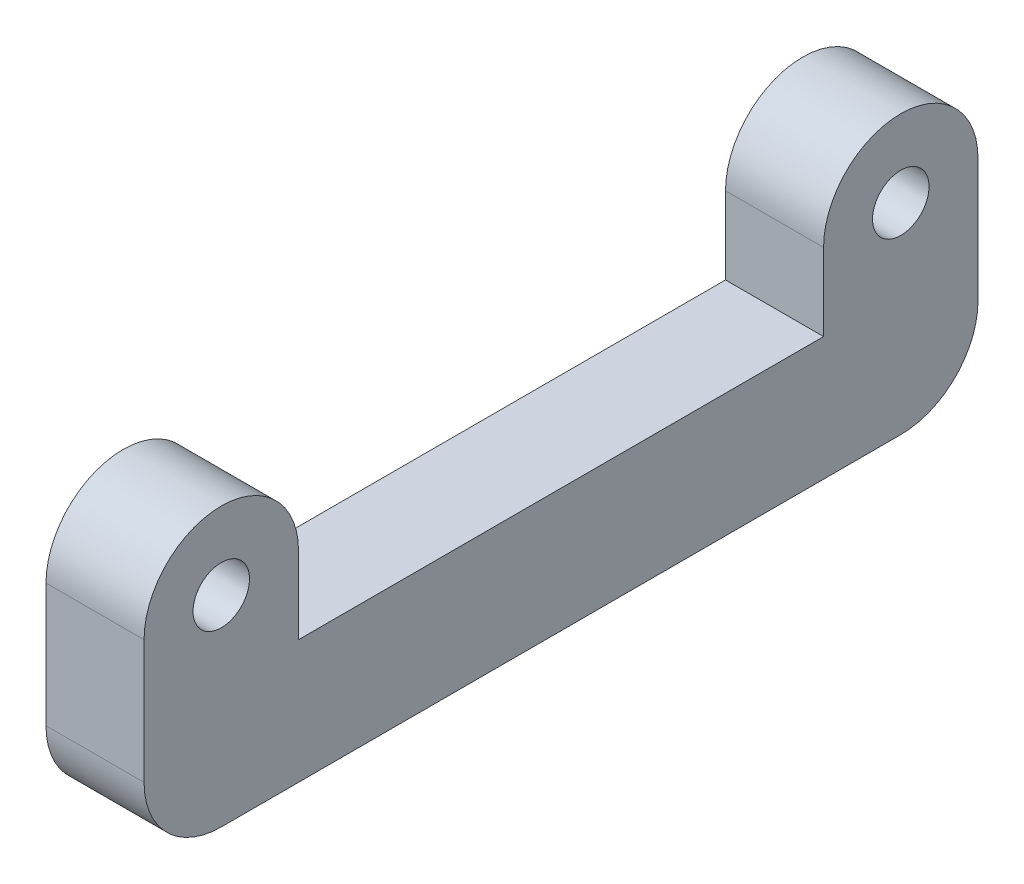
ISO-10303-21;
HEADER;
FILE_DESCRIPTION(('STEP AP214'),'2;1');
FILE_NAME('part.step','',(''),(''),'','','');
FILE_SCHEMA(('AUTOMOTIVE_DESIGN { 1 0 10303 214 1 1 1 1 }'));
ENDSEC;
DATA;
#1=APPLICATION_CONTEXT('core data for automotive mechanical design processes');
#2=APPLICATION_PROTOCOL_DEFINITION('international standard','automotive_design',2000,#1);
#3=PRODUCT_CONTEXT('',#1,'mechanical');
#4=PRODUCT('Part','Part','',(#3));
#5=PRODUCT_RELATED_PRODUCT_CATEGORY('part','',(#4));
#6=PRODUCT_DEFINITION_FORMATION('','',#4);
#7=PRODUCT_DEFINITION_CONTEXT('part definition',#1,'design');
#8=PRODUCT_DEFINITION('design','',#6,#7);
#9=PRODUCT_DEFINITION_SHAPE('','',#8);
#10=(LENGTH_UNIT() NAMED_UNIT(*) SI_UNIT(.MILLI.,.METRE.));
#11=(NAMED_UNIT(*) PLANE_ANGLE_UNIT() SI_UNIT($,.RADIAN.));
#12=(NAMED_UNIT(*) SI_UNIT($,.STERADIAN.) SOLID_ANGLE_UNIT());
#13=UNCERTAINTY_MEASURE_WITH_UNIT(LENGTH_MEASURE(1.E-05),#10,'distance_accuracy_value','');
#14=(GEOMETRIC_REPRESENTATION_CONTEXT(3) GLOBAL_UNCERTAINTY_ASSIGNED_CONTEXT((#13)) GLOBAL_UNIT_ASSIGNED_CONTEXT((#10,
#11,#12)) REPRESENTATION_CONTEXT('',''));
#15=CARTESIAN_POINT('',(0.,0.,0.));
#16=DIRECTION('',(0.,0.,1.));
#17=DIRECTION('',(1.,0.,0.));
#18=AXIS2_PLACEMENT_3D('',#15,#16,#17);
#19=CARTESIAN_POINT('',(6.35,9.00000000000001,22.));
#20=DIRECTION('',(-1.,0.,0.));
#21=DIRECTION('',(0.,0.,1.));
#22=AXIS2_PLACEMENT_3D('',#19,#20,#21);
#23=CYLINDRICAL_SURFACE('',#22,5.);
#24=CARTESIAN_POINT('',(0.,9.00000000000001,22.));
#25=DIRECTION('',(1.,0.,0.));
#26=DIRECTION('',(0.,0.,1.));
#27=AXIS2_PLACEMENT_3D('',#24,#25,#26);
#28=CIRCLE('',#27,5.);
#29=CARTESIAN_POINT('',(0.,9.00000000000001,17.));
#30=VERTEX_POINT('',#29);
#31=CARTESIAN_POINT('',(0.,9.,27.));
#32=VERTEX_POINT('',#31);
#33=EDGE_CURVE('E130',#30,#32,#28,.T.);
#34=ORIENTED_EDGE('',*,*,#33,.T.);
#35=DIRECTION('',(-1.,0.,0.));
#36=VECTOR('',#35,1.);
#37=CARTESIAN_POINT('',(6.35,9.,27.));
#38=LINE('',#37,#36);
#39=CARTESIAN_POINT('',(6.35,9.,27.));
#40=VERTEX_POINT('',#39);
#41=EDGE_CURVE('E113',#40,#32,#38,.T.);
#42=ORIENTED_EDGE('',*,*,#41,.F.);
#43=CARTESIAN_POINT('',(6.35,9.00000000000001,22.));
#44=DIRECTION('',(1.,0.,0.));
#45=DIRECTION('',(0.,0.,1.));
#46=AXIS2_PLACEMENT_3D('',#43,#44,#45);
#47=CIRCLE('',#46,5.);
#48=CARTESIAN_POINT('',(6.35,9.00000000000001,17.));
#49=VERTEX_POINT('',#48);
#50=EDGE_CURVE('E118',#49,#40,#47,.T.);
#51=ORIENTED_EDGE('',*,*,#50,.F.);
#52=DIRECTION('',(-1.,0.,0.));
#53=VECTOR('',#52,1.);
#54=CARTESIAN_POINT('',(6.35,9.00000000000001,17.));
#55=LINE('',#54,#53);
#56=EDGE_CURVE('E184',#49,#30,#55,.T.);
#57=ORIENTED_EDGE('',*,*,#56,.T.);
#58=EDGE_LOOP('',(#34,#42,#51,#57));
#59=FACE_BOUND('',#58,.T.);
#60=ADVANCED_FACE('F33',(#59),#23,.T.);
#61=CARTESIAN_POINT('',(6.35,-4.,27.));
#62=DIRECTION('',(0.,0.,-1.));
#63=DIRECTION('',(-1.,0.,0.));
#64=AXIS2_PLACEMENT_3D('',#61,#62,#63);
#65=PLANE('',#64);
#66=DIRECTION('',(0.,-1.,0.));
#67=VECTOR('',#66,1.);
#68=CARTESIAN_POINT('',(0.,-4.,27.));
#69=LINE('',#68,#67);
#70=CARTESIAN_POINT('',(0.,0.999999999999999,27.));
#71=VERTEX_POINT('',#70);
#72=EDGE_CURVE('E171',#32,#71,#69,.T.);
#73=ORIENTED_EDGE('',*,*,#72,.T.);
#74=DIRECTION('',(-1.,0.,0.));
#75=VECTOR('',#74,1.);
#76=CARTESIAN_POINT('',(6.35,0.999999999999999,27.));
#77=LINE('',#76,#75);
#78=CARTESIAN_POINT('',(6.35,0.999999999999999,27.));
#79=VERTEX_POINT('',#78);
#80=EDGE_CURVE('E11',#71,#79,#77,.F.);
#81=ORIENTED_EDGE('',*,*,#80,.T.);
#82=DIRECTION('',(0.,-1.,0.));
#83=VECTOR('',#82,1.);
#84=CARTESIAN_POINT('',(6.35,4.,27.));
#85=LINE('',#84,#83);
#86=EDGE_CURVE('E109',#40,#79,#85,.T.);
#87=ORIENTED_EDGE('',*,*,#86,.F.);
#88=ORIENTED_EDGE('',*,*,#41,.T.);
#89=EDGE_LOOP('',(#73,#81,#87,#88));
#90=FACE_BOUND('',#89,.T.);
#91=ADVANCED_FACE('F111',(#90),#65,.F.);
#92=CARTESIAN_POINT('',(6.35,-4.,27.));
#93=DIRECTION('',(0.,1.,0.));
#94=DIRECTION('',(0.,0.,1.));
#95=AXIS2_PLACEMENT_3D('',#92,#93,#94);
#96=PLANE('',#95);
#97=DIRECTION('',(0.,0.,-1.));
#98=VECTOR('',#97,1.);
#99=CARTESIAN_POINT('',(0.,-4.,27.));
#100=LINE('',#99,#98);
#101=CARTESIAN_POINT('',(0.,-4.,22.));
#102=VERTEX_POINT('',#101);
#103=CARTESIAN_POINT('',(0.,-4.,-22.));
#104=VERTEX_POINT('',#103);
#105=EDGE_CURVE('E166',#102,#104,#100,.T.);
#106=ORIENTED_EDGE('',*,*,#105,.T.);
#107=DIRECTION('',(-1.,0.,0.));
#108=VECTOR('',#107,1.);
#109=CARTESIAN_POINT('',(6.35,-4.,-22.));
#110=LINE('',#109,#108);
#111=CARTESIAN_POINT('',(6.35,-4.,-22.));
#112=VERTEX_POINT('',#111);
#113=EDGE_CURVE('E54',#104,#112,#110,.F.);
#114=ORIENTED_EDGE('',*,*,#113,.T.);
#115=DIRECTION('',(0.,0.,-1.));
#116=VECTOR('',#115,1.);
#117=CARTESIAN_POINT('',(6.35,-4.,27.));
#118=LINE('',#117,#116);
#119=CARTESIAN_POINT('',(6.35,-4.,22.));
#120=VERTEX_POINT('',#119);
#121=EDGE_CURVE('E117',#120,#112,#118,.T.);
#122=ORIENTED_EDGE('',*,*,#121,.F.);
#123=DIRECTION('',(-1.,0.,0.));
#124=VECTOR('',#123,1.);
#125=CARTESIAN_POINT('',(6.35,-4.,22.));
#126=LINE('',#125,#124);
#127=EDGE_CURVE('E145',#120,#102,#126,.T.);
#128=ORIENTED_EDGE('',*,*,#127,.T.);
#129=EDGE_LOOP('',(#106,#114,#122,#128));
#130=FACE_BOUND('',#129,.T.);
#131=ADVANCED_FACE('F169',(#130),#96,.F.);
#132=CARTESIAN_POINT('',(6.35,4.,-27.));
#133=DIRECTION('',(0.,0.,1.));
#134=DIRECTION('',(0.,-1.,0.));
#135=AXIS2_PLACEMENT_3D('',#132,#133,#134);
#136=PLANE('',#135);
#137=DIRECTION('',(0.,1.,0.));
#138=VECTOR('',#137,1.);
#139=CARTESIAN_POINT('',(6.35,-4.,-27.));
#140=LINE('',#139,#138);
#141=CARTESIAN_POINT('',(6.35,1.00000000000002,-27.));
#142=VERTEX_POINT('',#141);
#143=CARTESIAN_POINT('',(6.35,9.00000000000001,-27.));
#144=VERTEX_POINT('',#143);
#145=EDGE_CURVE('E152',#142,#144,#140,.T.);
#146=ORIENTED_EDGE('',*,*,#145,.F.);
#147=DIRECTION('',(-1.,0.,0.));
#148=VECTOR('',#147,1.);
#149=CARTESIAN_POINT('',(6.35,1.00000000000002,-27.));
#150=LINE('',#149,#148);
#151=CARTESIAN_POINT('',(0.,1.00000000000002,-27.));
#152=VERTEX_POINT('',#151);
#153=EDGE_CURVE('E131',#142,#152,#150,.T.);
#154=ORIENTED_EDGE('',*,*,#153,.T.);
#155=DIRECTION('',(0.,1.,0.));
#156=VECTOR('',#155,1.);
#157=CARTESIAN_POINT('',(0.,4.,-27.));
#158=LINE('',#157,#156);
#159=CARTESIAN_POINT('',(0.,9.00000000000001,-27.));
#160=VERTEX_POINT('',#159);
#161=EDGE_CURVE('E168',#152,#160,#158,.T.);
#162=ORIENTED_EDGE('',*,*,#161,.T.);
#163=DIRECTION('',(-1.,0.,0.));
#164=VECTOR('',#163,1.);
#165=CARTESIAN_POINT('',(6.35,9.00000000000001,-27.));
#166=LINE('',#165,#164);
#167=EDGE_CURVE('E132',#144,#160,#166,.T.);
#168=ORIENTED_EDGE('',*,*,#167,.F.);
#169=EDGE_LOOP('',(#146,#154,#162,#168));
#170=FACE_BOUND('',#169,.T.);
#171=ADVANCED_FACE('F157',(#170),#136,.F.);
#172=CARTESIAN_POINT('',(6.35,9.00000000000001,-22.));
#173=DIRECTION('',(-1.,0.,0.));
#174=DIRECTION('',(0.,0.,1.));
#175=AXIS2_PLACEMENT_3D('',#172,#173,#174);
#176=CYLINDRICAL_SURFACE('',#175,5.);
#177=CARTESIAN_POINT('',(0.,9.00000000000001,-22.));
#178=DIRECTION('',(1.,0.,0.));
#179=DIRECTION('',(0.,0.,1.));
#180=AXIS2_PLACEMENT_3D('',#177,#178,#179);
#181=CIRCLE('',#180,5.);
#182=CARTESIAN_POINT('',(0.,9.00000000000001,-17.));
#183=VERTEX_POINT('',#182);
#184=EDGE_CURVE('E173',#160,#183,#181,.T.);
#185=ORIENTED_EDGE('',*,*,#184,.T.);
#186=DIRECTION('',(-1.,0.,0.));
#187=VECTOR('',#186,1.);
#188=CARTESIAN_POINT('',(6.35,9.00000000000001,-17.));
#189=LINE('',#188,#187);
#190=CARTESIAN_POINT('',(6.35,9.00000000000001,-17.));
#191=VERTEX_POINT('',#190);
#192=EDGE_CURVE('E138',#191,#183,#189,.T.);
#193=ORIENTED_EDGE('',*,*,#192,.F.);
#194=CARTESIAN_POINT('',(6.35,9.00000000000001,-22.));
#195=DIRECTION('',(1.,0.,0.));
#196=DIRECTION('',(0.,0.,1.));
#197=AXIS2_PLACEMENT_3D('',#194,#195,#196);
#198=CIRCLE('',#197,5.);
#199=EDGE_CURVE('E160',#144,#191,#198,.T.);
#200=ORIENTED_EDGE('',*,*,#199,.F.);
#201=ORIENTED_EDGE('',*,*,#167,.T.);
#202=EDGE_LOOP('',(#185,#193,#200,#201));
#203=FACE_BOUND('',#202,.T.);
#204=ADVANCED_FACE('F224',(#203),#176,.T.);
#205=CARTESIAN_POINT('',(6.35,4.,-17.));
#206=DIRECTION('',(0.,0.,-1.));
#207=DIRECTION('',(-1.,0.,0.));
#208=AXIS2_PLACEMENT_3D('',#205,#206,#207);
#209=PLANE('',#208);
#210=DIRECTION('',(0.,-1.,0.));
#211=VECTOR('',#210,1.);
#212=CARTESIAN_POINT('',(0.,4.,-17.));
#213=LINE('',#212,#211);
#214=CARTESIAN_POINT('',(0.,4.,-17.));
#215=VERTEX_POINT('',#214);
#216=EDGE_CURVE('E179',#183,#215,#213,.T.);
#217=ORIENTED_EDGE('',*,*,#216,.T.);
#218=DIRECTION('',(-1.,0.,0.));
#219=VECTOR('',#218,1.);
#220=CARTESIAN_POINT('',(6.35,4.,-17.));
#221=LINE('',#220,#219);
#222=CARTESIAN_POINT('',(6.35,4.,-17.));
#223=VERTEX_POINT('',#222);
#224=EDGE_CURVE('E189',#223,#215,#221,.T.);
#225=ORIENTED_EDGE('',*,*,#224,.F.);
#226=DIRECTION('',(0.,-1.,0.));
#227=VECTOR('',#226,1.);
#228=CARTESIAN_POINT('',(6.35,4.,-17.));
#229=LINE('',#228,#227);
#230=EDGE_CURVE('E198',#191,#223,#229,.T.);
#231=ORIENTED_EDGE('',*,*,#230,.F.);
#232=ORIENTED_EDGE('',*,*,#192,.T.);
#233=EDGE_LOOP('',(#217,#225,#231,#232));
#234=FACE_BOUND('',#233,.T.);
#235=ADVANCED_FACE('F196',(#234),#209,.F.);
#236=CARTESIAN_POINT('',(6.35,4.,17.));
#237=DIRECTION('',(0.,-1.,0.));
#238=DIRECTION('',(0.,0.,-1.));
#239=AXIS2_PLACEMENT_3D('',#236,#237,#238);
#240=PLANE('',#239);
#241=DIRECTION('',(0.,0.,1.));
#242=VECTOR('',#241,1.);
#243=CARTESIAN_POINT('',(0.,4.,17.));
#244=LINE('',#243,#242);
#245=CARTESIAN_POINT('',(0.,4.,17.));
#246=VERTEX_POINT('',#245);
#247=EDGE_CURVE('E181',#215,#246,#244,.T.);
#248=ORIENTED_EDGE('',*,*,#247,.T.);
#249=DIRECTION('',(-1.,0.,0.));
#250=VECTOR('',#249,1.);
#251=CARTESIAN_POINT('',(6.35,4.,17.));
#252=LINE('',#251,#250);
#253=CARTESIAN_POINT('',(6.35,4.,17.));
#254=VERTEX_POINT('',#253);
#255=EDGE_CURVE('E186',#254,#246,#252,.T.);
#256=ORIENTED_EDGE('',*,*,#255,.F.);
#257=DIRECTION('',(0.,0.,1.));
#258=VECTOR('',#257,1.);
#259=CARTESIAN_POINT('',(6.35,4.,17.));
#260=LINE('',#259,#258);
#261=EDGE_CURVE('E208',#223,#254,#260,.T.);
#262=ORIENTED_EDGE('',*,*,#261,.F.);
#263=ORIENTED_EDGE('',*,*,#224,.T.);
#264=EDGE_LOOP('',(#248,#256,#262,#263));
#265=FACE_BOUND('',#264,.T.);
#266=ADVANCED_FACE('F204',(#265),#240,.F.);
#267=CARTESIAN_POINT('',(6.35,4.,17.));
#268=DIRECTION('',(0.,0.,1.));
#269=DIRECTION('',(0.,-1.,0.));
#270=AXIS2_PLACEMENT_3D('',#267,#268,#269);
#271=PLANE('',#270);
#272=DIRECTION('',(0.,1.,0.));
#273=VECTOR('',#272,1.);
#274=CARTESIAN_POINT('',(0.,4.,17.));
#275=LINE('',#274,#273);
#276=EDGE_CURVE('E127',#246,#30,#275,.T.);
#277=ORIENTED_EDGE('',*,*,#276,.T.);
#278=ORIENTED_EDGE('',*,*,#56,.F.);
#279=DIRECTION('',(0.,1.,0.));
#280=VECTOR('',#279,1.);
#281=CARTESIAN_POINT('',(6.35,4.,17.));
#282=LINE('',#281,#280);
#283=EDGE_CURVE('E123',#254,#49,#282,.T.);
#284=ORIENTED_EDGE('',*,*,#283,.F.);
#285=ORIENTED_EDGE('',*,*,#255,.T.);
#286=EDGE_LOOP('',(#277,#278,#284,#285));
#287=FACE_BOUND('',#286,.T.);
#288=ADVANCED_FACE('F207',(#287),#271,.F.);
#289=CARTESIAN_POINT('',(6.35,9.00000000000001,22.));
#290=DIRECTION('',(-1.,0.,0.));
#291=DIRECTION('',(0.,0.,1.));
#292=AXIS2_PLACEMENT_3D('',#289,#290,#291);
#293=PLANE('',#292);
#294=CARTESIAN_POINT('',(6.35,9.00000000000001,-22.));
#295=DIRECTION('',(-1.,0.,0.));
#296=DIRECTION('',(0.,0.,1.));
#297=AXIS2_PLACEMENT_3D('',#294,#295,#296);
#298=CIRCLE('',#297,1.8288);
#299=CARTESIAN_POINT('',(6.35,9.00000000000001,-20.1712));
#300=VERTEX_POINT('',#299);
#301=EDGE_CURVE('E219',#300,#300,#298,.T.);
#302=ORIENTED_EDGE('',*,*,#301,.T.);
#303=EDGE_LOOP('',(#302));
#304=FACE_BOUND('',#303,.T.);
#305=CARTESIAN_POINT('',(6.35,9.00000000000001,22.));
#306=DIRECTION('',(-1.,0.,0.));
#307=DIRECTION('',(0.,0.,1.));
#308=AXIS2_PLACEMENT_3D('',#305,#306,#307);
#309=CIRCLE('',#308,1.8288);
#310=CARTESIAN_POINT('',(6.35,9.00000000000001,23.8288));
#311=VERTEX_POINT('',#310);
#312=EDGE_CURVE('E212',#311,#311,#309,.T.);
#313=ORIENTED_EDGE('',*,*,#312,.T.);
#314=EDGE_LOOP('',(#313));
#315=FACE_BOUND('',#314,.T.);
#316=ORIENTED_EDGE('',*,*,#121,.T.);
#317=CARTESIAN_POINT('',(6.35,1.,-22.));
#318=DIRECTION('',(-1.,0.,0.));
#319=DIRECTION('',(0.,0.,1.));
#320=AXIS2_PLACEMENT_3D('',#317,#318,#319);
#321=CIRCLE('',#320,5.);
#322=EDGE_CURVE('E41',#112,#142,#321,.F.);
#323=ORIENTED_EDGE('',*,*,#322,.T.);
#324=ORIENTED_EDGE('',*,*,#145,.T.);
#325=ORIENTED_EDGE('',*,*,#199,.T.);
#326=ORIENTED_EDGE('',*,*,#230,.T.);
#327=ORIENTED_EDGE('',*,*,#261,.T.);
#328=ORIENTED_EDGE('',*,*,#283,.T.);
#329=ORIENTED_EDGE('',*,*,#50,.T.);
#330=ORIENTED_EDGE('',*,*,#86,.T.);
#331=CARTESIAN_POINT('',(6.35,0.999999999999999,22.));
#332=DIRECTION('',(-1.,0.,0.));
#333=DIRECTION('',(0.,0.,1.));
#334=AXIS2_PLACEMENT_3D('',#331,#332,#333);
#335=CIRCLE('',#334,5.);
#336=EDGE_CURVE('E149',#79,#120,#335,.F.);
#337=ORIENTED_EDGE('',*,*,#336,.T.);
#338=EDGE_LOOP('',(#316,#323,#324,#325,#326,#327,#328,#329,#330,#337));
#339=FACE_BOUND('',#338,.T.);
#340=ADVANCED_FACE('F121',(#304,#315,#339),#293,.F.);
#341=CARTESIAN_POINT('',(0.,9.00000000000001,22.));
#342=DIRECTION('',(-1.,0.,0.));
#343=DIRECTION('',(0.,0.,1.));
#344=AXIS2_PLACEMENT_3D('',#341,#342,#343);
#345=PLANE('',#344);
#346=CARTESIAN_POINT('',(0.,9.00000000000001,-22.));
#347=DIRECTION('',(-1.,0.,0.));
#348=DIRECTION('',(0.,0.,1.));
#349=AXIS2_PLACEMENT_3D('',#346,#347,#348);
#350=CIRCLE('',#349,1.8288);
#351=CARTESIAN_POINT('',(0.,9.00000000000001,-20.1712));
#352=VERTEX_POINT('',#351);
#353=EDGE_CURVE('E308',#352,#352,#350,.T.);
#354=ORIENTED_EDGE('',*,*,#353,.F.);
#355=EDGE_LOOP('',(#354));
#356=FACE_BOUND('',#355,.T.);
#357=CARTESIAN_POINT('',(0.,9.00000000000001,22.));
#358=DIRECTION('',(-1.,0.,0.));
#359=DIRECTION('',(0.,0.,1.));
#360=AXIS2_PLACEMENT_3D('',#357,#358,#359);
#361=CIRCLE('',#360,1.8288);
#362=CARTESIAN_POINT('',(0.,9.00000000000001,23.8288));
#363=VERTEX_POINT('',#362);
#364=EDGE_CURVE('E214',#363,#363,#361,.T.);
#365=ORIENTED_EDGE('',*,*,#364,.F.);
#366=EDGE_LOOP('',(#365));
#367=FACE_BOUND('',#366,.T.);
#368=ORIENTED_EDGE('',*,*,#161,.F.);
#369=CARTESIAN_POINT('',(0.,1.,-22.));
#370=DIRECTION('',(-1.,0.,0.));
#371=DIRECTION('',(0.,0.,1.));
#372=AXIS2_PLACEMENT_3D('',#369,#370,#371);
#373=CIRCLE('',#372,5.);
#374=EDGE_CURVE('E143',#152,#104,#373,.T.);
#375=ORIENTED_EDGE('',*,*,#374,.T.);
#376=ORIENTED_EDGE('',*,*,#105,.F.);
#377=CARTESIAN_POINT('',(0.,0.999999999999999,22.));
#378=DIRECTION('',(-1.,0.,0.));
#379=DIRECTION('',(0.,0.,1.));
#380=AXIS2_PLACEMENT_3D('',#377,#378,#379);
#381=CIRCLE('',#380,5.);
#382=EDGE_CURVE('E135',#102,#71,#381,.T.);
#383=ORIENTED_EDGE('',*,*,#382,.T.);
#384=ORIENTED_EDGE('',*,*,#72,.F.);
#385=ORIENTED_EDGE('',*,*,#33,.F.);
#386=ORIENTED_EDGE('',*,*,#276,.F.);
#387=ORIENTED_EDGE('',*,*,#247,.F.);
#388=ORIENTED_EDGE('',*,*,#216,.F.);
#389=ORIENTED_EDGE('',*,*,#184,.F.);
#390=EDGE_LOOP('',(#368,#375,#376,#383,#384,#385,#386,#387,#388,#389));
#391=FACE_BOUND('',#390,.T.);
#392=ADVANCED_FACE('F165',(#356,#367,#391),#345,.T.);
#393=CARTESIAN_POINT('',(6.35,1.,-22.));
#394=DIRECTION('',(-1.,0.,0.));
#395=DIRECTION('',(0.,0.,1.));
#396=AXIS2_PLACEMENT_3D('',#393,#394,#395);
#397=CYLINDRICAL_SURFACE('',#396,5.);
#398=ORIENTED_EDGE('',*,*,#322,.F.);
#399=ORIENTED_EDGE('',*,*,#113,.F.);
#400=ORIENTED_EDGE('',*,*,#374,.F.);
#401=ORIENTED_EDGE('',*,*,#153,.F.);
#402=EDGE_LOOP('',(#398,#399,#400,#401));
#403=FACE_BOUND('',#402,.T.);
#404=ADVANCED_FACE('F162',(#403),#397,.T.);
#405=CARTESIAN_POINT('',(6.35,0.999999999999999,22.));
#406=DIRECTION('',(-1.,0.,0.));
#407=DIRECTION('',(0.,0.,1.));
#408=AXIS2_PLACEMENT_3D('',#405,#406,#407);
#409=CYLINDRICAL_SURFACE('',#408,5.);
#410=ORIENTED_EDGE('',*,*,#336,.F.);
#411=ORIENTED_EDGE('',*,*,#80,.F.);
#412=ORIENTED_EDGE('',*,*,#382,.F.);
#413=ORIENTED_EDGE('',*,*,#127,.F.);
#414=EDGE_LOOP('',(#410,#411,#412,#413));
#415=FACE_BOUND('',#414,.T.);
#416=ADVANCED_FACE('F35',(#415),#409,.T.);
#417=CARTESIAN_POINT('',(0.,9.00000000000001,22.));
#418=DIRECTION('',(-1.,0.,0.));
#419=DIRECTION('',(0.,0.,1.));
#420=AXIS2_PLACEMENT_3D('',#417,#418,#419);
#421=CYLINDRICAL_SURFACE('',#420,1.8288);
#422=ORIENTED_EDGE('',*,*,#312,.F.);
#423=EDGE_LOOP('',(#422));
#424=FACE_BOUND('',#423,.T.);
#425=ORIENTED_EDGE('',*,*,#364,.T.);
#426=EDGE_LOOP('',(#425));
#427=FACE_BOUND('',#426,.T.);
#428=ADVANCED_FACE('F245',(#424,#427),#421,.F.);
#429=CARTESIAN_POINT('',(0.,9.00000000000001,-22.));
#430=DIRECTION('',(-1.,0.,0.));
#431=DIRECTION('',(0.,0.,1.));
#432=AXIS2_PLACEMENT_3D('',#429,#430,#431);
#433=CYLINDRICAL_SURFACE('',#432,1.8288);
#434=ORIENTED_EDGE('',*,*,#301,.F.);
#435=EDGE_LOOP('',(#434));
#436=FACE_BOUND('',#435,.T.);
#437=ORIENTED_EDGE('',*,*,#353,.T.);
#438=EDGE_LOOP('',(#437));
#439=FACE_BOUND('',#438,.T.);
#440=ADVANCED_FACE('F291',(#436,#439),#433,.F.);
#441=CLOSED_SHELL('',(#60,#91,#131,#171,#204,#235,#266,#288,#340,#392,#404,#416,#428,#440));
#442=MANIFOLD_SOLID_BREP('B2',#441);
#443=ADVANCED_BREP_SHAPE_REPRESENTATION('',(#18,#442),#14);
#444=SHAPE_DEFINITION_REPRESENTATION(#9,#443);
ENDSEC;
END-ISO-10303-21;
